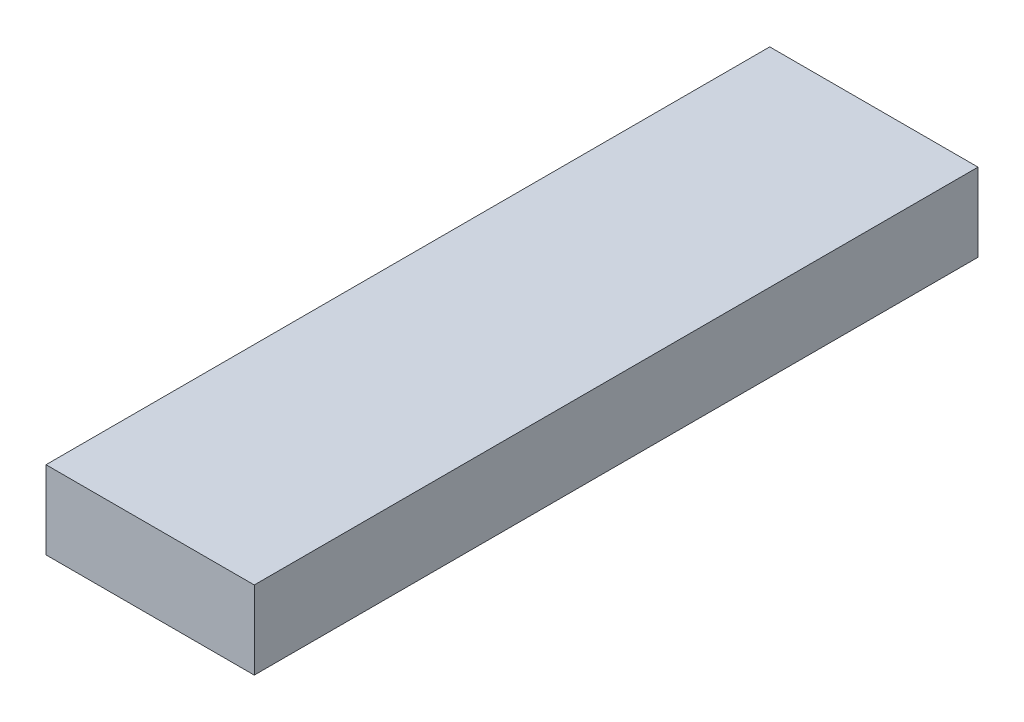
ISO-10303-21;
HEADER;
FILE_DESCRIPTION(('STEP AP214'),'2;1');
FILE_NAME('part.step','',(''),(''),'','','');
FILE_SCHEMA(('AUTOMOTIVE_DESIGN { 1 0 10303 214 1 1 1 1 }'));
ENDSEC;
DATA;
#1=APPLICATION_CONTEXT('core data for automotive mechanical design processes');
#2=APPLICATION_PROTOCOL_DEFINITION('international standard','automotive_design',2000,#1);
#3=PRODUCT_CONTEXT('',#1,'mechanical');
#4=PRODUCT('Part','Part','',(#3));
#5=PRODUCT_RELATED_PRODUCT_CATEGORY('part','',(#4));
#6=PRODUCT_DEFINITION_FORMATION('','',#4);
#7=PRODUCT_DEFINITION_CONTEXT('part definition',#1,'design');
#8=PRODUCT_DEFINITION('design','',#6,#7);
#9=PRODUCT_DEFINITION_SHAPE('','',#8);
#10=(LENGTH_UNIT() NAMED_UNIT(*) SI_UNIT(.MILLI.,.METRE.));
#11=(NAMED_UNIT(*) PLANE_ANGLE_UNIT() SI_UNIT($,.RADIAN.));
#12=(NAMED_UNIT(*) SI_UNIT($,.STERADIAN.) SOLID_ANGLE_UNIT());
#13=UNCERTAINTY_MEASURE_WITH_UNIT(LENGTH_MEASURE(1.E-05),#10,'distance_accuracy_value','');
#14=(GEOMETRIC_REPRESENTATION_CONTEXT(3) GLOBAL_UNCERTAINTY_ASSIGNED_CONTEXT((#13)) GLOBAL_UNIT_ASSIGNED_CONTEXT((#10,
#11,#12)) REPRESENTATION_CONTEXT('',''));
#15=CARTESIAN_POINT('',(0.,0.,0.));
#16=DIRECTION('',(0.,0.,1.));
#17=DIRECTION('',(1.,0.,0.));
#18=AXIS2_PLACEMENT_3D('',#15,#16,#17);
#19=CARTESIAN_POINT('',(0.,30.,0.));
#20=DIRECTION('',(1.,0.,0.));
#21=DIRECTION('',(0.,0.,-1.));
#22=AXIS2_PLACEMENT_3D('',#19,#20,#21);
#23=PLANE('',#22);
#24=DIRECTION('',(0.,0.,1.));
#25=VECTOR('',#24,1.);
#26=CARTESIAN_POINT('',(0.,0.,0.));
#27=LINE('',#26,#25);
#28=CARTESIAN_POINT('',(0.,0.,-278.));
#29=VERTEX_POINT('',#28);
#30=CARTESIAN_POINT('',(0.,0.,0.));
#31=VERTEX_POINT('',#30);
#32=EDGE_CURVE('E95',#29,#31,#27,.T.);
#33=ORIENTED_EDGE('',*,*,#32,.T.);
#34=DIRECTION('',(0.,-1.,0.));
#35=VECTOR('',#34,1.);
#36=CARTESIAN_POINT('',(0.,30.,0.));
#37=LINE('',#36,#35);
#38=CARTESIAN_POINT('',(0.,30.,0.));
#39=VERTEX_POINT('',#38);
#40=EDGE_CURVE('E11',#39,#31,#37,.T.);
#41=ORIENTED_EDGE('',*,*,#40,.F.);
#42=DIRECTION('',(0.,0.,1.));
#43=VECTOR('',#42,1.);
#44=CARTESIAN_POINT('',(0.,30.,0.));
#45=LINE('',#44,#43);
#46=CARTESIAN_POINT('',(0.,30.,-278.));
#47=VERTEX_POINT('',#46);
#48=EDGE_CURVE('E83',#47,#39,#45,.T.);
#49=ORIENTED_EDGE('',*,*,#48,.F.);
#50=DIRECTION('',(0.,-1.,0.));
#51=VECTOR('',#50,1.);
#52=CARTESIAN_POINT('',(0.,30.,-278.));
#53=LINE('',#52,#51);
#54=EDGE_CURVE('E91',#47,#29,#53,.T.);
#55=ORIENTED_EDGE('',*,*,#54,.T.);
#56=EDGE_LOOP('',(#33,#41,#49,#55));
#57=FACE_BOUND('',#56,.T.);
#58=ADVANCED_FACE('F32',(#57),#23,.F.);
#59=CARTESIAN_POINT('',(0.,30.,0.));
#60=DIRECTION('',(0.,0.,-1.));
#61=DIRECTION('',(-1.,0.,0.));
#62=AXIS2_PLACEMENT_3D('',#59,#60,#61);
#63=PLANE('',#62);
#64=DIRECTION('',(1.,0.,0.));
#65=VECTOR('',#64,1.);
#66=CARTESIAN_POINT('',(0.,0.,0.));
#67=LINE('',#66,#65);
#68=CARTESIAN_POINT('',(80.,0.,0.));
#69=VERTEX_POINT('',#68);
#70=EDGE_CURVE('E87',#31,#69,#67,.T.);
#71=ORIENTED_EDGE('',*,*,#70,.T.);
#72=DIRECTION('',(0.,-1.,0.));
#73=VECTOR('',#72,1.);
#74=CARTESIAN_POINT('',(80.,30.,0.));
#75=LINE('',#74,#73);
#76=CARTESIAN_POINT('',(80.,30.,0.));
#77=VERTEX_POINT('',#76);
#78=EDGE_CURVE('E40',#77,#69,#75,.T.);
#79=ORIENTED_EDGE('',*,*,#78,.F.);
#80=DIRECTION('',(1.,0.,0.));
#81=VECTOR('',#80,1.);
#82=CARTESIAN_POINT('',(0.,30.,0.));
#83=LINE('',#82,#81);
#84=EDGE_CURVE('E78',#39,#77,#83,.T.);
#85=ORIENTED_EDGE('',*,*,#84,.F.);
#86=ORIENTED_EDGE('',*,*,#40,.T.);
#87=EDGE_LOOP('',(#71,#79,#85,#86));
#88=FACE_BOUND('',#87,.T.);
#89=ADVANCED_FACE('F86',(#88),#63,.F.);
#90=CARTESIAN_POINT('',(80.,30.,0.));
#91=DIRECTION('',(-1.,0.,0.));
#92=DIRECTION('',(0.,0.,1.));
#93=AXIS2_PLACEMENT_3D('',#90,#91,#92);
#94=PLANE('',#93);
#95=DIRECTION('',(0.,0.,-1.));
#96=VECTOR('',#95,1.);
#97=CARTESIAN_POINT('',(80.,0.,0.));
#98=LINE('',#97,#96);
#99=CARTESIAN_POINT('',(80.,0.,-278.));
#100=VERTEX_POINT('',#99);
#101=EDGE_CURVE('E65',#69,#100,#98,.T.);
#102=ORIENTED_EDGE('',*,*,#101,.T.);
#103=DIRECTION('',(0.,-1.,0.));
#104=VECTOR('',#103,1.);
#105=CARTESIAN_POINT('',(80.,30.,-278.));
#106=LINE('',#105,#104);
#107=CARTESIAN_POINT('',(80.,30.,-278.));
#108=VERTEX_POINT('',#107);
#109=EDGE_CURVE('E88',#108,#100,#106,.T.);
#110=ORIENTED_EDGE('',*,*,#109,.F.);
#111=DIRECTION('',(0.,0.,-1.));
#112=VECTOR('',#111,1.);
#113=CARTESIAN_POINT('',(80.,30.,0.));
#114=LINE('',#113,#112);
#115=EDGE_CURVE('E81',#77,#108,#114,.T.);
#116=ORIENTED_EDGE('',*,*,#115,.F.);
#117=ORIENTED_EDGE('',*,*,#78,.T.);
#118=EDGE_LOOP('',(#102,#110,#116,#117));
#119=FACE_BOUND('',#118,.T.);
#120=ADVANCED_FACE('F89',(#119),#94,.F.);
#121=CARTESIAN_POINT('',(0.,30.,-278.));
#122=DIRECTION('',(0.,0.,1.));
#123=DIRECTION('',(1.,0.,0.));
#124=AXIS2_PLACEMENT_3D('',#121,#122,#123);
#125=PLANE('',#124);
#126=DIRECTION('',(-1.,0.,0.));
#127=VECTOR('',#126,1.);
#128=CARTESIAN_POINT('',(0.,0.,-278.));
#129=LINE('',#128,#127);
#130=EDGE_CURVE('E71',#100,#29,#129,.T.);
#131=ORIENTED_EDGE('',*,*,#130,.T.);
#132=ORIENTED_EDGE('',*,*,#54,.F.);
#133=DIRECTION('',(-1.,0.,0.));
#134=VECTOR('',#133,1.);
#135=CARTESIAN_POINT('',(0.,30.,-278.));
#136=LINE('',#135,#134);
#137=EDGE_CURVE('E48',#108,#47,#136,.T.);
#138=ORIENTED_EDGE('',*,*,#137,.F.);
#139=ORIENTED_EDGE('',*,*,#109,.T.);
#140=EDGE_LOOP('',(#131,#132,#138,#139));
#141=FACE_BOUND('',#140,.T.);
#142=ADVANCED_FACE('F102',(#141),#125,.F.);
#143=CARTESIAN_POINT('',(0.,30.,0.));
#144=DIRECTION('',(0.,-1.,0.));
#145=DIRECTION('',(0.,0.,-1.));
#146=AXIS2_PLACEMENT_3D('',#143,#144,#145);
#147=PLANE('',#146);
#148=ORIENTED_EDGE('',*,*,#48,.T.);
#149=ORIENTED_EDGE('',*,*,#84,.T.);
#150=ORIENTED_EDGE('',*,*,#115,.T.);
#151=ORIENTED_EDGE('',*,*,#137,.T.);
#152=EDGE_LOOP('',(#148,#149,#150,#151));
#153=FACE_BOUND('',#152,.T.);
#154=ADVANCED_FACE('F79',(#153),#147,.F.);
#155=CARTESIAN_POINT('',(0.,0.,0.));
#156=DIRECTION('',(0.,-1.,0.));
#157=DIRECTION('',(0.,0.,-1.));
#158=AXIS2_PLACEMENT_3D('',#155,#156,#157);
#159=PLANE('',#158);
#160=ORIENTED_EDGE('',*,*,#32,.F.);
#161=ORIENTED_EDGE('',*,*,#130,.F.);
#162=ORIENTED_EDGE('',*,*,#101,.F.);
#163=ORIENTED_EDGE('',*,*,#70,.F.);
#164=EDGE_LOOP('',(#160,#161,#162,#163));
#165=FACE_BOUND('',#164,.T.);
#166=ADVANCED_FACE('F105',(#165),#159,.T.);
#167=CLOSED_SHELL('',(#58,#89,#120,#142,#154,#166));
#168=MANIFOLD_SOLID_BREP('B2',#167);
#169=ADVANCED_BREP_SHAPE_REPRESENTATION('',(#18,#168),#14);
#170=SHAPE_DEFINITION_REPRESENTATION(#9,#169);
ENDSEC;
END-ISO-10303-21;
